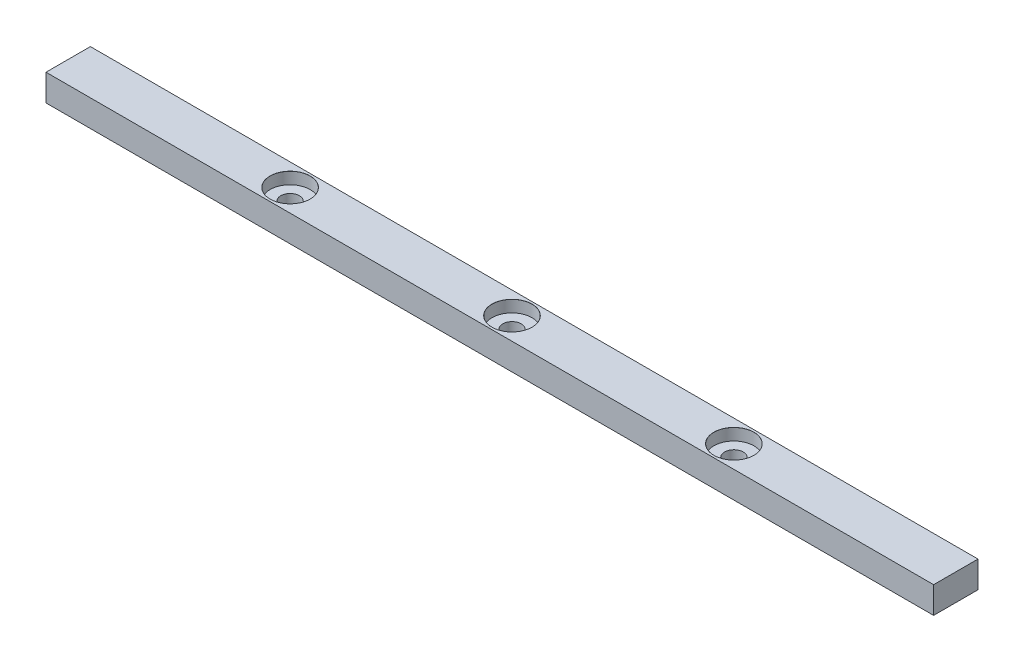
ISO-10303-21;
HEADER;
FILE_DESCRIPTION(('STEP AP214'),'2;1');
FILE_NAME('part.step','',(''),(''),'','','');
FILE_SCHEMA(('AUTOMOTIVE_DESIGN { 1 0 10303 214 1 1 1 1 }'));
ENDSEC;
DATA;
#1=APPLICATION_CONTEXT('core data for automotive mechanical design processes');
#2=APPLICATION_PROTOCOL_DEFINITION('international standard','automotive_design',2000,#1);
#3=PRODUCT_CONTEXT('',#1,'mechanical');
#4=PRODUCT('Part','Part','',(#3));
#5=PRODUCT_RELATED_PRODUCT_CATEGORY('part','',(#4));
#6=PRODUCT_DEFINITION_FORMATION('','',#4);
#7=PRODUCT_DEFINITION_CONTEXT('part definition',#1,'design');
#8=PRODUCT_DEFINITION('design','',#6,#7);
#9=PRODUCT_DEFINITION_SHAPE('','',#8);
#10=(LENGTH_UNIT() NAMED_UNIT(*) SI_UNIT(.MILLI.,.METRE.));
#11=(NAMED_UNIT(*) PLANE_ANGLE_UNIT() SI_UNIT($,.RADIAN.));
#12=(NAMED_UNIT(*) SI_UNIT($,.STERADIAN.) SOLID_ANGLE_UNIT());
#13=UNCERTAINTY_MEASURE_WITH_UNIT(LENGTH_MEASURE(1.E-05),#10,'distance_accuracy_value','');
#14=(GEOMETRIC_REPRESENTATION_CONTEXT(3) GLOBAL_UNCERTAINTY_ASSIGNED_CONTEXT((#13)) GLOBAL_UNIT_ASSIGNED_CONTEXT((#10,
#11,#12)) REPRESENTATION_CONTEXT('',''));
#15=CARTESIAN_POINT('',(0.,0.,0.));
#16=DIRECTION('',(0.,0.,1.));
#17=DIRECTION('',(1.,0.,0.));
#18=AXIS2_PLACEMENT_3D('',#15,#16,#17);
#19=CARTESIAN_POINT('',(200.,12.,9.99999999999999));
#20=DIRECTION('',(-1.,0.,0.));
#21=DIRECTION('',(0.,0.,1.));
#22=AXIS2_PLACEMENT_3D('',#19,#20,#21);
#23=PLANE('',#22);
#24=DIRECTION('',(0.,0.,-1.));
#25=VECTOR('',#24,1.);
#26=CARTESIAN_POINT('',(200.,0.,9.99999999999999));
#27=LINE('',#26,#25);
#28=CARTESIAN_POINT('',(200.,0.,9.99999999999999));
#29=VERTEX_POINT('',#28);
#30=CARTESIAN_POINT('',(200.,0.,-10.));
#31=VERTEX_POINT('',#30);
#32=EDGE_CURVE('E107',#29,#31,#27,.T.);
#33=ORIENTED_EDGE('',*,*,#32,.T.);
#34=DIRECTION('',(0.,-1.,0.));
#35=VECTOR('',#34,1.);
#36=CARTESIAN_POINT('',(200.,12.,-10.));
#37=LINE('',#36,#35);
#38=CARTESIAN_POINT('',(200.,12.,-10.));
#39=VERTEX_POINT('',#38);
#40=EDGE_CURVE('E11',#39,#31,#37,.T.);
#41=ORIENTED_EDGE('',*,*,#40,.F.);
#42=DIRECTION('',(0.,0.,-1.));
#43=VECTOR('',#42,1.);
#44=CARTESIAN_POINT('',(200.,12.,9.99999999999999));
#45=LINE('',#44,#43);
#46=CARTESIAN_POINT('',(200.,12.,9.99999999999999));
#47=VERTEX_POINT('',#46);
#48=EDGE_CURVE('E91',#47,#39,#45,.T.);
#49=ORIENTED_EDGE('',*,*,#48,.F.);
#50=DIRECTION('',(0.,-1.,0.));
#51=VECTOR('',#50,1.);
#52=CARTESIAN_POINT('',(200.,12.,9.99999999999999));
#53=LINE('',#52,#51);
#54=EDGE_CURVE('E103',#47,#29,#53,.T.);
#55=ORIENTED_EDGE('',*,*,#54,.T.);
#56=EDGE_LOOP('',(#33,#41,#49,#55));
#57=FACE_BOUND('',#56,.T.);
#58=ADVANCED_FACE('F39',(#57),#23,.F.);
#59=CARTESIAN_POINT('',(-200.,12.,-10.));
#60=DIRECTION('',(0.,0.,1.));
#61=DIRECTION('',(1.,0.,0.));
#62=AXIS2_PLACEMENT_3D('',#59,#60,#61);
#63=PLANE('',#62);
#64=DIRECTION('',(-1.,0.,0.));
#65=VECTOR('',#64,1.);
#66=CARTESIAN_POINT('',(-200.,0.,-10.));
#67=LINE('',#66,#65);
#68=CARTESIAN_POINT('',(-200.,0.,-10.));
#69=VERTEX_POINT('',#68);
#70=EDGE_CURVE('E96',#31,#69,#67,.T.);
#71=ORIENTED_EDGE('',*,*,#70,.T.);
#72=DIRECTION('',(0.,-1.,0.));
#73=VECTOR('',#72,1.);
#74=CARTESIAN_POINT('',(-200.,12.,-10.));
#75=LINE('',#74,#73);
#76=CARTESIAN_POINT('',(-200.,12.,-10.));
#77=VERTEX_POINT('',#76);
#78=EDGE_CURVE('E48',#77,#69,#75,.T.);
#79=ORIENTED_EDGE('',*,*,#78,.F.);
#80=DIRECTION('',(-1.,0.,0.));
#81=VECTOR('',#80,1.);
#82=CARTESIAN_POINT('',(-200.,12.,-10.));
#83=LINE('',#82,#81);
#84=EDGE_CURVE('E86',#39,#77,#83,.T.);
#85=ORIENTED_EDGE('',*,*,#84,.F.);
#86=ORIENTED_EDGE('',*,*,#40,.T.);
#87=EDGE_LOOP('',(#71,#79,#85,#86));
#88=FACE_BOUND('',#87,.T.);
#89=ADVANCED_FACE('F95',(#88),#63,.F.);
#90=CARTESIAN_POINT('',(-200.,12.,9.99999999999999));
#91=DIRECTION('',(1.,0.,0.));
#92=DIRECTION('',(0.,0.,-1.));
#93=AXIS2_PLACEMENT_3D('',#90,#91,#92);
#94=PLANE('',#93);
#95=DIRECTION('',(0.,0.,1.));
#96=VECTOR('',#95,1.);
#97=CARTESIAN_POINT('',(-200.,0.,9.99999999999999));
#98=LINE('',#97,#96);
#99=CARTESIAN_POINT('',(-200.,0.,9.99999999999999));
#100=VERTEX_POINT('',#99);
#101=EDGE_CURVE('E73',#69,#100,#98,.T.);
#102=ORIENTED_EDGE('',*,*,#101,.T.);
#103=DIRECTION('',(0.,-1.,0.));
#104=VECTOR('',#103,1.);
#105=CARTESIAN_POINT('',(-200.,12.,9.99999999999999));
#106=LINE('',#105,#104);
#107=CARTESIAN_POINT('',(-200.,12.,9.99999999999999));
#108=VERTEX_POINT('',#107);
#109=EDGE_CURVE('E98',#108,#100,#106,.T.);
#110=ORIENTED_EDGE('',*,*,#109,.F.);
#111=DIRECTION('',(0.,0.,1.));
#112=VECTOR('',#111,1.);
#113=CARTESIAN_POINT('',(-200.,12.,9.99999999999999));
#114=LINE('',#113,#112);
#115=EDGE_CURVE('E89',#77,#108,#114,.T.);
#116=ORIENTED_EDGE('',*,*,#115,.F.);
#117=ORIENTED_EDGE('',*,*,#78,.T.);
#118=EDGE_LOOP('',(#102,#110,#116,#117));
#119=FACE_BOUND('',#118,.T.);
#120=ADVANCED_FACE('F99',(#119),#94,.F.);
#121=CARTESIAN_POINT('',(-200.,12.,9.99999999999999));
#122=DIRECTION('',(0.,0.,-1.));
#123=DIRECTION('',(-1.,0.,0.));
#124=AXIS2_PLACEMENT_3D('',#121,#122,#123);
#125=PLANE('',#124);
#126=DIRECTION('',(1.,0.,0.));
#127=VECTOR('',#126,1.);
#128=CARTESIAN_POINT('',(-200.,0.,9.99999999999999));
#129=LINE('',#128,#127);
#130=EDGE_CURVE('E79',#100,#29,#129,.T.);
#131=ORIENTED_EDGE('',*,*,#130,.T.);
#132=ORIENTED_EDGE('',*,*,#54,.F.);
#133=DIRECTION('',(1.,0.,0.));
#134=VECTOR('',#133,1.);
#135=CARTESIAN_POINT('',(-200.,12.,9.99999999999999));
#136=LINE('',#135,#134);
#137=EDGE_CURVE('E56',#108,#47,#136,.T.);
#138=ORIENTED_EDGE('',*,*,#137,.F.);
#139=ORIENTED_EDGE('',*,*,#109,.T.);
#140=EDGE_LOOP('',(#131,#132,#138,#139));
#141=FACE_BOUND('',#140,.T.);
#142=ADVANCED_FACE('F121',(#141),#125,.F.);
#143=CARTESIAN_POINT('',(0.,12.,0.));
#144=DIRECTION('',(0.,-1.,0.));
#145=DIRECTION('',(0.,0.,-1.));
#146=AXIS2_PLACEMENT_3D('',#143,#144,#145);
#147=PLANE('',#146);
#148=CARTESIAN_POINT('',(0.,12.,0.));
#149=DIRECTION('',(0.,1.,0.));
#150=DIRECTION('',(0.,0.,1.));
#151=AXIS2_PLACEMENT_3D('',#148,#149,#150);
#152=CIRCLE('',#151,9.0305);
#153=CARTESIAN_POINT('',(0.,12.,9.0305));
#154=VERTEX_POINT('',#153);
#155=EDGE_CURVE('E183',#154,#154,#152,.T.);
#156=ORIENTED_EDGE('',*,*,#155,.F.);
#157=EDGE_LOOP('',(#156));
#158=FACE_BOUND('',#157,.T.);
#159=CARTESIAN_POINT('',(100.,12.,0.));
#160=DIRECTION('',(0.,1.,0.));
#161=DIRECTION('',(0.,0.,1.));
#162=AXIS2_PLACEMENT_3D('',#159,#160,#161);
#163=CIRCLE('',#162,9.0305);
#164=CARTESIAN_POINT('',(100.,12.,9.0305));
#165=VERTEX_POINT('',#164);
#166=EDGE_CURVE('E163',#165,#165,#163,.T.);
#167=ORIENTED_EDGE('',*,*,#166,.F.);
#168=EDGE_LOOP('',(#167));
#169=FACE_BOUND('',#168,.T.);
#170=CARTESIAN_POINT('',(-100.,12.,0.));
#171=DIRECTION('',(0.,1.,0.));
#172=DIRECTION('',(0.,0.,1.));
#173=AXIS2_PLACEMENT_3D('',#170,#171,#172);
#174=CIRCLE('',#173,9.0305);
#175=CARTESIAN_POINT('',(-100.,12.,9.0305));
#176=VERTEX_POINT('',#175);
#177=EDGE_CURVE('E143',#176,#176,#174,.T.);
#178=ORIENTED_EDGE('',*,*,#177,.F.);
#179=EDGE_LOOP('',(#178));
#180=FACE_BOUND('',#179,.T.);
#181=ORIENTED_EDGE('',*,*,#48,.T.);
#182=ORIENTED_EDGE('',*,*,#84,.T.);
#183=ORIENTED_EDGE('',*,*,#115,.T.);
#184=ORIENTED_EDGE('',*,*,#137,.T.);
#185=EDGE_LOOP('',(#181,#182,#183,#184));
#186=FACE_BOUND('',#185,.T.);
#187=ADVANCED_FACE('F87',(#158,#169,#180,#186),#147,.F.);
#188=CARTESIAN_POINT('',(0.,0.,0.));
#189=DIRECTION('',(0.,-1.,0.));
#190=DIRECTION('',(0.,0.,-1.));
#191=AXIS2_PLACEMENT_3D('',#188,#189,#190);
#192=PLANE('',#191);
#193=CARTESIAN_POINT('',(0.,0.,0.));
#194=DIRECTION('',(0.,1.,0.));
#195=DIRECTION('',(0.,0.,1.));
#196=AXIS2_PLACEMENT_3D('',#193,#194,#195);
#197=CIRCLE('',#196,4.2);
#198=CARTESIAN_POINT('',(0.,0.,4.2));
#199=VERTEX_POINT('',#198);
#200=EDGE_CURVE('E167',#199,#199,#197,.T.);
#201=ORIENTED_EDGE('',*,*,#200,.T.);
#202=EDGE_LOOP('',(#201));
#203=FACE_BOUND('',#202,.T.);
#204=CARTESIAN_POINT('',(100.,0.,0.));
#205=DIRECTION('',(0.,1.,0.));
#206=DIRECTION('',(0.,0.,1.));
#207=AXIS2_PLACEMENT_3D('',#204,#205,#206);
#208=CIRCLE('',#207,4.2);
#209=CARTESIAN_POINT('',(100.,0.,4.2));
#210=VERTEX_POINT('',#209);
#211=EDGE_CURVE('E147',#210,#210,#208,.T.);
#212=ORIENTED_EDGE('',*,*,#211,.T.);
#213=EDGE_LOOP('',(#212));
#214=FACE_BOUND('',#213,.T.);
#215=CARTESIAN_POINT('',(-100.,0.,0.));
#216=DIRECTION('',(0.,1.,0.));
#217=DIRECTION('',(0.,0.,1.));
#218=AXIS2_PLACEMENT_3D('',#215,#216,#217);
#219=CIRCLE('',#218,4.2);
#220=CARTESIAN_POINT('',(-100.,0.,4.2));
#221=VERTEX_POINT('',#220);
#222=EDGE_CURVE('E111',#221,#221,#219,.T.);
#223=ORIENTED_EDGE('',*,*,#222,.T.);
#224=EDGE_LOOP('',(#223));
#225=FACE_BOUND('',#224,.T.);
#226=ORIENTED_EDGE('',*,*,#32,.F.);
#227=ORIENTED_EDGE('',*,*,#130,.F.);
#228=ORIENTED_EDGE('',*,*,#101,.F.);
#229=ORIENTED_EDGE('',*,*,#70,.F.);
#230=EDGE_LOOP('',(#226,#227,#228,#229));
#231=FACE_BOUND('',#230,.T.);
#232=ADVANCED_FACE('F124',(#203,#214,#225,#231),#192,.T.);
#233=CARTESIAN_POINT('',(-100.,12.,0.));
#234=DIRECTION('',(0.,1.,0.));
#235=DIRECTION('',(0.,0.,1.));
#236=AXIS2_PLACEMENT_3D('',#233,#234,#235);
#237=CYLINDRICAL_SURFACE('',#236,4.2);
#238=ORIENTED_EDGE('',*,*,#222,.F.);
#239=EDGE_LOOP('',(#238));
#240=FACE_BOUND('',#239,.T.);
#241=CARTESIAN_POINT('',(-100.,6.7,0.));
#242=DIRECTION('',(0.,1.,0.));
#243=DIRECTION('',(0.,0.,1.));
#244=AXIS2_PLACEMENT_3D('',#241,#242,#243);
#245=CIRCLE('',#244,4.2);
#246=CARTESIAN_POINT('',(-100.,6.7,4.2));
#247=VERTEX_POINT('',#246);
#248=EDGE_CURVE('E131',#247,#247,#245,.T.);
#249=ORIENTED_EDGE('',*,*,#248,.T.);
#250=EDGE_LOOP('',(#249));
#251=FACE_BOUND('',#250,.T.);
#252=ADVANCED_FACE('F226',(#240,#251),#237,.F.);
#253=CARTESIAN_POINT('',(-90.9945000000001,6.7,0.));
#254=DIRECTION('',(0.,-1.,0.));
#255=DIRECTION('',(0.,0.,-1.));
#256=AXIS2_PLACEMENT_3D('',#253,#254,#255);
#257=PLANE('',#256);
#258=ORIENTED_EDGE('',*,*,#248,.F.);
#259=EDGE_LOOP('',(#258));
#260=FACE_BOUND('',#259,.T.);
#261=CARTESIAN_POINT('',(-100.,6.7,0.));
#262=DIRECTION('',(0.,1.,0.));
#263=DIRECTION('',(0.,0.,1.));
#264=AXIS2_PLACEMENT_3D('',#261,#262,#263);
#265=CIRCLE('',#264,9.0055);
#266=CARTESIAN_POINT('',(-100.,6.7,9.0055));
#267=VERTEX_POINT('',#266);
#268=EDGE_CURVE('E135',#267,#267,#265,.T.);
#269=ORIENTED_EDGE('',*,*,#268,.T.);
#270=EDGE_LOOP('',(#269));
#271=FACE_BOUND('',#270,.T.);
#272=ADVANCED_FACE('F210',(#260,#271),#257,.F.);
#273=CARTESIAN_POINT('',(-100.,12.,0.));
#274=DIRECTION('',(0.,1.,0.));
#275=DIRECTION('',(0.,0.,1.));
#276=AXIS2_PLACEMENT_3D('',#273,#274,#275);
#277=CYLINDRICAL_SURFACE('',#276,9.0055);
#278=ORIENTED_EDGE('',*,*,#268,.F.);
#279=EDGE_LOOP('',(#278));
#280=FACE_BOUND('',#279,.T.);
#281=CARTESIAN_POINT('',(-100.,11.975,0.));
#282=DIRECTION('',(0.,1.,0.));
#283=DIRECTION('',(0.,0.,1.));
#284=AXIS2_PLACEMENT_3D('',#281,#282,#283);
#285=CIRCLE('',#284,9.0055);
#286=CARTESIAN_POINT('',(-100.,11.975,9.0055));
#287=VERTEX_POINT('',#286);
#288=EDGE_CURVE('E139',#287,#287,#285,.T.);
#289=ORIENTED_EDGE('',*,*,#288,.T.);
#290=EDGE_LOOP('',(#289));
#291=FACE_BOUND('',#290,.T.);
#292=ADVANCED_FACE('F200',(#280,#291),#277,.F.);
#293=CARTESIAN_POINT('',(-100.,12.,0.));
#294=DIRECTION('',(0.,1.,0.));
#295=DIRECTION('',(0.,0.,1.));
#296=AXIS2_PLACEMENT_3D('',#293,#294,#295);
#297=CONICAL_SURFACE('',#296,9.0305,0.785398163397379);
#298=ORIENTED_EDGE('',*,*,#288,.F.);
#299=EDGE_LOOP('',(#298));
#300=FACE_BOUND('',#299,.T.);
#301=ORIENTED_EDGE('',*,*,#177,.T.);
#302=EDGE_LOOP('',(#301));
#303=FACE_BOUND('',#302,.T.);
#304=ADVANCED_FACE('F197',(#300,#303),#297,.F.);
#305=CARTESIAN_POINT('',(100.,12.,0.));
#306=DIRECTION('',(0.,1.,0.));
#307=DIRECTION('',(0.,0.,1.));
#308=AXIS2_PLACEMENT_3D('',#305,#306,#307);
#309=CYLINDRICAL_SURFACE('',#308,4.2);
#310=ORIENTED_EDGE('',*,*,#211,.F.);
#311=EDGE_LOOP('',(#310));
#312=FACE_BOUND('',#311,.T.);
#313=CARTESIAN_POINT('',(100.,6.7,0.));
#314=DIRECTION('',(0.,1.,0.));
#315=DIRECTION('',(0.,0.,1.));
#316=AXIS2_PLACEMENT_3D('',#313,#314,#315);
#317=CIRCLE('',#316,4.2);
#318=CARTESIAN_POINT('',(100.,6.7,4.2));
#319=VERTEX_POINT('',#318);
#320=EDGE_CURVE('E151',#319,#319,#317,.T.);
#321=ORIENTED_EDGE('',*,*,#320,.T.);
#322=EDGE_LOOP('',(#321));
#323=FACE_BOUND('',#322,.T.);
#324=ADVANCED_FACE('F199',(#312,#323),#309,.F.);
#325=CARTESIAN_POINT('',(109.0055,6.7,0.));
#326=DIRECTION('',(0.,-1.,0.));
#327=DIRECTION('',(0.,0.,-1.));
#328=AXIS2_PLACEMENT_3D('',#325,#326,#327);
#329=PLANE('',#328);
#330=ORIENTED_EDGE('',*,*,#320,.F.);
#331=EDGE_LOOP('',(#330));
#332=FACE_BOUND('',#331,.T.);
#333=CARTESIAN_POINT('',(100.,6.7,0.));
#334=DIRECTION('',(0.,1.,0.));
#335=DIRECTION('',(0.,0.,1.));
#336=AXIS2_PLACEMENT_3D('',#333,#334,#335);
#337=CIRCLE('',#336,9.0055);
#338=CARTESIAN_POINT('',(100.,6.7,9.0055));
#339=VERTEX_POINT('',#338);
#340=EDGE_CURVE('E155',#339,#339,#337,.T.);
#341=ORIENTED_EDGE('',*,*,#340,.T.);
#342=EDGE_LOOP('',(#341));
#343=FACE_BOUND('',#342,.T.);
#344=ADVANCED_FACE('F207',(#332,#343),#329,.F.);
#345=CARTESIAN_POINT('',(100.,12.,0.));
#346=DIRECTION('',(0.,1.,0.));
#347=DIRECTION('',(0.,0.,1.));
#348=AXIS2_PLACEMENT_3D('',#345,#346,#347);
#349=CYLINDRICAL_SURFACE('',#348,9.0055);
#350=ORIENTED_EDGE('',*,*,#340,.F.);
#351=EDGE_LOOP('',(#350));
#352=FACE_BOUND('',#351,.T.);
#353=CARTESIAN_POINT('',(100.,11.975,0.));
#354=DIRECTION('',(0.,1.,0.));
#355=DIRECTION('',(0.,0.,1.));
#356=AXIS2_PLACEMENT_3D('',#353,#354,#355);
#357=CIRCLE('',#356,9.0055);
#358=CARTESIAN_POINT('',(100.,11.975,9.0055));
#359=VERTEX_POINT('',#358);
#360=EDGE_CURVE('E159',#359,#359,#357,.T.);
#361=ORIENTED_EDGE('',*,*,#360,.T.);
#362=EDGE_LOOP('',(#361));
#363=FACE_BOUND('',#362,.T.);
#364=ADVANCED_FACE('F266',(#352,#363),#349,.F.);
#365=CARTESIAN_POINT('',(100.,12.,0.));
#366=DIRECTION('',(0.,1.,0.));
#367=DIRECTION('',(0.,0.,1.));
#368=AXIS2_PLACEMENT_3D('',#365,#366,#367);
#369=CONICAL_SURFACE('',#368,9.0305,0.785398163397379);
#370=ORIENTED_EDGE('',*,*,#360,.F.);
#371=EDGE_LOOP('',(#370));
#372=FACE_BOUND('',#371,.T.);
#373=ORIENTED_EDGE('',*,*,#166,.T.);
#374=EDGE_LOOP('',(#373));
#375=FACE_BOUND('',#374,.T.);
#376=ADVANCED_FACE('F276',(#372,#375),#369,.F.);
#377=CARTESIAN_POINT('',(0.,12.,0.));
#378=DIRECTION('',(0.,1.,0.));
#379=DIRECTION('',(0.,0.,1.));
#380=AXIS2_PLACEMENT_3D('',#377,#378,#379);
#381=CYLINDRICAL_SURFACE('',#380,4.2);
#382=ORIENTED_EDGE('',*,*,#200,.F.);
#383=EDGE_LOOP('',(#382));
#384=FACE_BOUND('',#383,.T.);
#385=CARTESIAN_POINT('',(0.,6.7,0.));
#386=DIRECTION('',(0.,1.,0.));
#387=DIRECTION('',(0.,0.,1.));
#388=AXIS2_PLACEMENT_3D('',#385,#386,#387);
#389=CIRCLE('',#388,4.2);
#390=CARTESIAN_POINT('',(0.,6.7,4.2));
#391=VERTEX_POINT('',#390);
#392=EDGE_CURVE('E171',#391,#391,#389,.T.);
#393=ORIENTED_EDGE('',*,*,#392,.T.);
#394=EDGE_LOOP('',(#393));
#395=FACE_BOUND('',#394,.T.);
#396=ADVANCED_FACE('F286',(#384,#395),#381,.F.);
#397=CARTESIAN_POINT('',(9.0055,6.7,0.));
#398=DIRECTION('',(0.,-1.,0.));
#399=DIRECTION('',(0.,0.,-1.));
#400=AXIS2_PLACEMENT_3D('',#397,#398,#399);
#401=PLANE('',#400);
#402=ORIENTED_EDGE('',*,*,#392,.F.);
#403=EDGE_LOOP('',(#402));
#404=FACE_BOUND('',#403,.T.);
#405=CARTESIAN_POINT('',(0.,6.7,0.));
#406=DIRECTION('',(0.,1.,0.));
#407=DIRECTION('',(0.,0.,1.));
#408=AXIS2_PLACEMENT_3D('',#405,#406,#407);
#409=CIRCLE('',#408,9.0055);
#410=CARTESIAN_POINT('',(0.,6.7,9.0055));
#411=VERTEX_POINT('',#410);
#412=EDGE_CURVE('E175',#411,#411,#409,.T.);
#413=ORIENTED_EDGE('',*,*,#412,.T.);
#414=EDGE_LOOP('',(#413));
#415=FACE_BOUND('',#414,.T.);
#416=ADVANCED_FACE('F296',(#404,#415),#401,.F.);
#417=CARTESIAN_POINT('',(0.,12.,0.));
#418=DIRECTION('',(0.,1.,0.));
#419=DIRECTION('',(0.,0.,1.));
#420=AXIS2_PLACEMENT_3D('',#417,#418,#419);
#421=CYLINDRICAL_SURFACE('',#420,9.0055);
#422=ORIENTED_EDGE('',*,*,#412,.F.);
#423=EDGE_LOOP('',(#422));
#424=FACE_BOUND('',#423,.T.);
#425=CARTESIAN_POINT('',(0.,11.975,0.));
#426=DIRECTION('',(0.,1.,0.));
#427=DIRECTION('',(0.,0.,1.));
#428=AXIS2_PLACEMENT_3D('',#425,#426,#427);
#429=CIRCLE('',#428,9.0055);
#430=CARTESIAN_POINT('',(0.,11.975,9.0055));
#431=VERTEX_POINT('',#430);
#432=EDGE_CURVE('E179',#431,#431,#429,.T.);
#433=ORIENTED_EDGE('',*,*,#432,.T.);
#434=EDGE_LOOP('',(#433));
#435=FACE_BOUND('',#434,.T.);
#436=ADVANCED_FACE('F306',(#424,#435),#421,.F.);
#437=CARTESIAN_POINT('',(0.,12.,0.));
#438=DIRECTION('',(0.,1.,0.));
#439=DIRECTION('',(0.,0.,1.));
#440=AXIS2_PLACEMENT_3D('',#437,#438,#439);
#441=CONICAL_SURFACE('',#440,9.0305,0.785398163397483);
#442=ORIENTED_EDGE('',*,*,#432,.F.);
#443=EDGE_LOOP('',(#442));
#444=FACE_BOUND('',#443,.T.);
#445=ORIENTED_EDGE('',*,*,#155,.T.);
#446=EDGE_LOOP('',(#445));
#447=FACE_BOUND('',#446,.T.);
#448=ADVANCED_FACE('F188',(#444,#447),#441,.F.);
#449=CLOSED_SHELL('',(#58,#89,#120,#142,#187,#232,#252,#272,#292,#304,#324,#344,#364,#376,#396,
#416,#436,#448));
#450=MANIFOLD_SOLID_BREP('B2',#449);
#451=ADVANCED_BREP_SHAPE_REPRESENTATION('',(#18,#450),#14);
#452=SHAPE_DEFINITION_REPRESENTATION(#9,#451);
ENDSEC;
END-ISO-10303-21;
